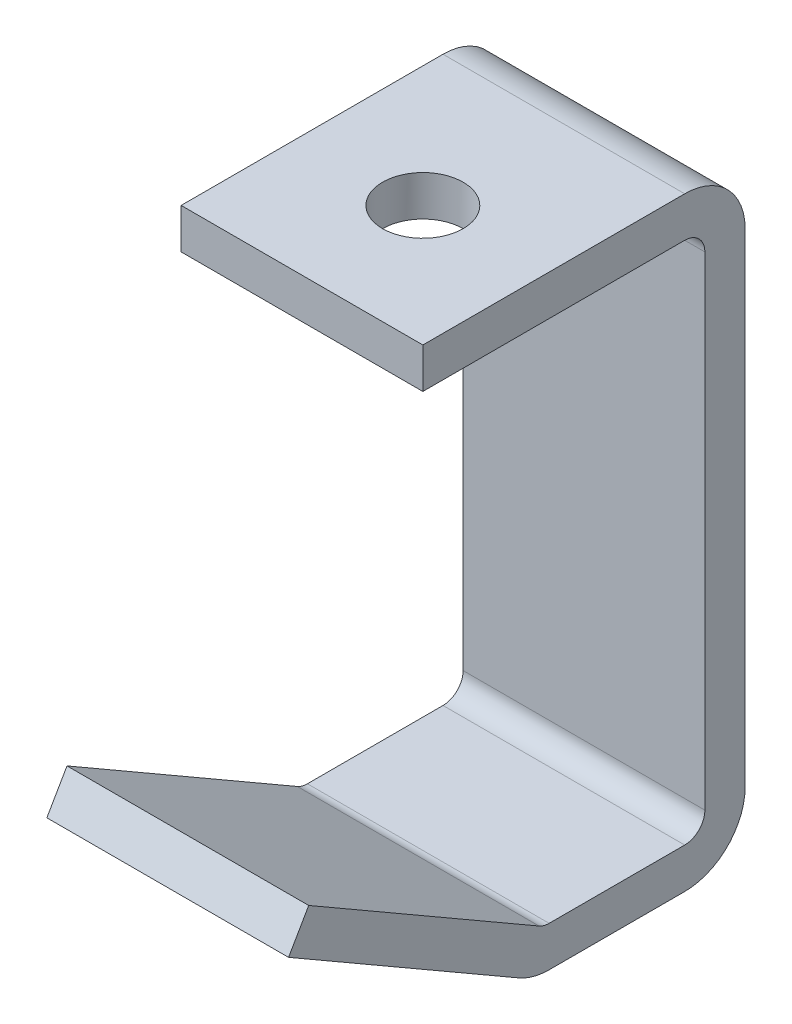
ISO-10303-21;
HEADER;
FILE_DESCRIPTION(('STEP AP214'),'2;1');
FILE_NAME('part.step','',(''),(''),'','','');
FILE_SCHEMA(('AUTOMOTIVE_DESIGN { 1 0 10303 214 1 1 1 1 }'));
ENDSEC;
DATA;
#1=APPLICATION_CONTEXT('core data for automotive mechanical design processes');
#2=APPLICATION_PROTOCOL_DEFINITION('international standard','automotive_design',2000,#1);
#3=PRODUCT_CONTEXT('',#1,'mechanical');
#4=PRODUCT('Part','Part','',(#3));
#5=PRODUCT_RELATED_PRODUCT_CATEGORY('part','',(#4));
#6=PRODUCT_DEFINITION_FORMATION('','',#4);
#7=PRODUCT_DEFINITION_CONTEXT('part definition',#1,'design');
#8=PRODUCT_DEFINITION('design','',#6,#7);
#9=PRODUCT_DEFINITION_SHAPE('','',#8);
#10=(LENGTH_UNIT() NAMED_UNIT(*) SI_UNIT(.MILLI.,.METRE.));
#11=(NAMED_UNIT(*) PLANE_ANGLE_UNIT() SI_UNIT($,.RADIAN.));
#12=(NAMED_UNIT(*) SI_UNIT($,.STERADIAN.) SOLID_ANGLE_UNIT());
#13=UNCERTAINTY_MEASURE_WITH_UNIT(LENGTH_MEASURE(1.E-05),#10,'distance_accuracy_value','');
#14=(GEOMETRIC_REPRESENTATION_CONTEXT(3) GLOBAL_UNCERTAINTY_ASSIGNED_CONTEXT((#13)) GLOBAL_UNIT_ASSIGNED_CONTEXT((#10,
#11,#12)) REPRESENTATION_CONTEXT('',''));
#15=CARTESIAN_POINT('',(0.,0.,0.));
#16=DIRECTION('',(0.,0.,1.));
#17=DIRECTION('',(1.,0.,0.));
#18=AXIS2_PLACEMENT_3D('',#15,#16,#17);
#19=CARTESIAN_POINT('',(19.05,88.9,3.175));
#20=DIRECTION('',(0.,-1.,0.));
#21=DIRECTION('',(0.,0.,-1.));
#22=AXIS2_PLACEMENT_3D('',#19,#20,#21);
#23=PLANE('',#22);
#24=CARTESIAN_POINT('',(0.,88.9,25.4));
#25=DIRECTION('',(0.,1.,0.));
#26=DIRECTION('',(0.,0.,1.));
#27=AXIS2_PLACEMENT_3D('',#24,#25,#26);
#28=CIRCLE('',#27,6.35);
#29=CARTESIAN_POINT('',(0.,88.9,31.75));
#30=VERTEX_POINT('',#29);
#31=EDGE_CURVE('E159',#30,#30,#28,.T.);
#32=ORIENTED_EDGE('',*,*,#31,.F.);
#33=EDGE_LOOP('',(#32));
#34=FACE_BOUND('',#33,.T.);
#35=DIRECTION('',(0.,0.,-1.));
#36=VECTOR('',#35,1.);
#37=CARTESIAN_POINT('',(-19.05,88.9,3.175));
#38=LINE('',#37,#36);
#39=CARTESIAN_POINT('',(-19.05,88.9,3.175));
#40=VERTEX_POINT('',#39);
#41=CARTESIAN_POINT('',(-19.05,88.9,44.45));
#42=VERTEX_POINT('',#41);
#43=EDGE_CURVE('E155',#40,#42,#38,.F.);
#44=ORIENTED_EDGE('',*,*,#43,.T.);
#45=DIRECTION('',(-1.,0.,0.));
#46=VECTOR('',#45,1.);
#47=CARTESIAN_POINT('',(19.05,88.9,44.45));
#48=LINE('',#47,#46);
#49=CARTESIAN_POINT('',(19.05,88.9,44.45));
#50=VERTEX_POINT('',#49);
#51=EDGE_CURVE('E11',#50,#42,#48,.T.);
#52=ORIENTED_EDGE('',*,*,#51,.F.);
#53=DIRECTION('',(0.,0.,-1.));
#54=VECTOR('',#53,1.);
#55=CARTESIAN_POINT('',(19.05,88.9,3.175));
#56=LINE('',#55,#54);
#57=CARTESIAN_POINT('',(19.05,88.9,3.175));
#58=VERTEX_POINT('',#57);
#59=EDGE_CURVE('E201',#58,#50,#56,.F.);
#60=ORIENTED_EDGE('',*,*,#59,.F.);
#61=DIRECTION('',(-1.,0.,0.));
#62=VECTOR('',#61,1.);
#63=CARTESIAN_POINT('',(19.05,88.9,3.175));
#64=LINE('',#63,#62);
#65=EDGE_CURVE('E156',#58,#40,#64,.T.);
#66=ORIENTED_EDGE('',*,*,#65,.T.);
#67=EDGE_LOOP('',(#44,#52,#60,#66));
#68=FACE_BOUND('',#67,.T.);
#69=ADVANCED_FACE('F33',(#34,#68),#23,.F.);
#70=CARTESIAN_POINT('',(19.05,82.55,44.45));
#71=DIRECTION('',(0.,0.,1.));
#72=DIRECTION('',(1.,0.,0.));
#73=AXIS2_PLACEMENT_3D('',#70,#71,#72);
#74=PLANE('',#73);
#75=DIRECTION('',(0.,1.,0.));
#76=VECTOR('',#75,1.);
#77=CARTESIAN_POINT('',(-19.05,82.55,44.45));
#78=LINE('',#77,#76);
#79=CARTESIAN_POINT('',(-19.05,82.55,44.45));
#80=VERTEX_POINT('',#79);
#81=EDGE_CURVE('E147',#80,#42,#78,.T.);
#82=ORIENTED_EDGE('',*,*,#81,.F.);
#83=DIRECTION('',(-1.,0.,0.));
#84=VECTOR('',#83,1.);
#85=CARTESIAN_POINT('',(19.05,82.55,44.45));
#86=LINE('',#85,#84);
#87=CARTESIAN_POINT('',(19.05,82.55,44.45));
#88=VERTEX_POINT('',#87);
#89=EDGE_CURVE('E40',#88,#80,#86,.T.);
#90=ORIENTED_EDGE('',*,*,#89,.F.);
#91=DIRECTION('',(0.,1.,0.));
#92=VECTOR('',#91,1.);
#93=CARTESIAN_POINT('',(19.05,82.55,44.45));
#94=LINE('',#93,#92);
#95=EDGE_CURVE('E150',#88,#50,#94,.T.);
#96=ORIENTED_EDGE('',*,*,#95,.T.);
#97=ORIENTED_EDGE('',*,*,#51,.T.);
#98=EDGE_LOOP('',(#82,#90,#96,#97));
#99=FACE_BOUND('',#98,.T.);
#100=ADVANCED_FACE('F145',(#99),#74,.T.);
#101=CARTESIAN_POINT('',(19.05,82.55,3.175));
#102=DIRECTION('',(0.,-1.,0.));
#103=DIRECTION('',(0.,0.,-1.));
#104=AXIS2_PLACEMENT_3D('',#101,#102,#103);
#105=PLANE('',#104);
#106=CARTESIAN_POINT('',(0.,82.55,25.4));
#107=DIRECTION('',(0.,-1.,0.));
#108=DIRECTION('',(0.,0.,-1.));
#109=AXIS2_PLACEMENT_3D('',#106,#107,#108);
#110=CIRCLE('',#109,6.35);
#111=CARTESIAN_POINT('',(0.,82.55,19.05));
#112=VERTEX_POINT('',#111);
#113=EDGE_CURVE('E342',#112,#112,#110,.F.);
#114=ORIENTED_EDGE('',*,*,#113,.T.);
#115=EDGE_LOOP('',(#114));
#116=FACE_BOUND('',#115,.T.);
#117=DIRECTION('',(0.,0.,1.));
#118=VECTOR('',#117,1.);
#119=CARTESIAN_POINT('',(-19.05,82.55,3.175));
#120=LINE('',#119,#118);
#121=CARTESIAN_POINT('',(-19.05,82.55,3.175));
#122=VERTEX_POINT('',#121);
#123=EDGE_CURVE('E164',#122,#80,#120,.T.);
#124=ORIENTED_EDGE('',*,*,#123,.F.);
#125=DIRECTION('',(-1.,0.,0.));
#126=VECTOR('',#125,1.);
#127=CARTESIAN_POINT('',(19.05,82.55,3.175));
#128=LINE('',#127,#126);
#129=CARTESIAN_POINT('',(19.05,82.55,3.175));
#130=VERTEX_POINT('',#129);
#131=EDGE_CURVE('E268',#130,#122,#128,.T.);
#132=ORIENTED_EDGE('',*,*,#131,.F.);
#133=DIRECTION('',(0.,0.,1.));
#134=VECTOR('',#133,1.);
#135=CARTESIAN_POINT('',(19.05,82.55,3.175));
#136=LINE('',#135,#134);
#137=EDGE_CURVE('E204',#130,#88,#136,.T.);
#138=ORIENTED_EDGE('',*,*,#137,.T.);
#139=ORIENTED_EDGE('',*,*,#89,.T.);
#140=EDGE_LOOP('',(#124,#132,#138,#139));
#141=FACE_BOUND('',#140,.T.);
#142=ADVANCED_FACE('F270',(#116,#141),#105,.T.);
#143=CARTESIAN_POINT('',(19.05,79.375,3.175));
#144=DIRECTION('',(-1.,0.,0.));
#145=DIRECTION('',(0.,0.,1.));
#146=AXIS2_PLACEMENT_3D('',#143,#144,#145);
#147=CYLINDRICAL_SURFACE('',#146,3.175);
#148=CARTESIAN_POINT('',(-19.05,79.375,3.175));
#149=DIRECTION('',(1.,0.,0.));
#150=DIRECTION('',(0.,0.,-1.));
#151=AXIS2_PLACEMENT_3D('',#148,#149,#150);
#152=CIRCLE('',#151,3.175);
#153=CARTESIAN_POINT('',(-19.05,79.375,0.));
#154=VERTEX_POINT('',#153);
#155=EDGE_CURVE('E166',#154,#122,#152,.T.);
#156=ORIENTED_EDGE('',*,*,#155,.F.);
#157=DIRECTION('',(-1.,0.,0.));
#158=VECTOR('',#157,1.);
#159=CARTESIAN_POINT('',(19.05,79.375,0.));
#160=LINE('',#159,#158);
#161=CARTESIAN_POINT('',(19.05,79.375,0.));
#162=VERTEX_POINT('',#161);
#163=EDGE_CURVE('E266',#162,#154,#160,.T.);
#164=ORIENTED_EDGE('',*,*,#163,.F.);
#165=CARTESIAN_POINT('',(19.05,79.375,3.175));
#166=DIRECTION('',(1.,0.,0.));
#167=DIRECTION('',(0.,0.,-1.));
#168=AXIS2_PLACEMENT_3D('',#165,#166,#167);
#169=CIRCLE('',#168,3.175);
#170=EDGE_CURVE('E207',#162,#130,#169,.T.);
#171=ORIENTED_EDGE('',*,*,#170,.T.);
#172=ORIENTED_EDGE('',*,*,#131,.T.);
#173=EDGE_LOOP('',(#156,#164,#171,#172));
#174=FACE_BOUND('',#173,.T.);
#175=ADVANCED_FACE('F277',(#174),#147,.F.);
#176=CARTESIAN_POINT('',(19.05,3.175,0.));
#177=DIRECTION('',(0.,0.,1.));
#178=DIRECTION('',(1.,0.,0.));
#179=AXIS2_PLACEMENT_3D('',#176,#177,#178);
#180=PLANE('',#179);
#181=DIRECTION('',(0.,1.,0.));
#182=VECTOR('',#181,1.);
#183=CARTESIAN_POINT('',(-19.05,3.175,0.));
#184=LINE('',#183,#182);
#185=CARTESIAN_POINT('',(-19.05,3.175,0.));
#186=VERTEX_POINT('',#185);
#187=EDGE_CURVE('E171',#186,#154,#184,.T.);
#188=ORIENTED_EDGE('',*,*,#187,.F.);
#189=DIRECTION('',(-1.,0.,0.));
#190=VECTOR('',#189,1.);
#191=CARTESIAN_POINT('',(19.05,3.175,0.));
#192=LINE('',#191,#190);
#193=CARTESIAN_POINT('',(19.05,3.175,0.));
#194=VERTEX_POINT('',#193);
#195=EDGE_CURVE('E264',#194,#186,#192,.T.);
#196=ORIENTED_EDGE('',*,*,#195,.F.);
#197=DIRECTION('',(0.,1.,0.));
#198=VECTOR('',#197,1.);
#199=CARTESIAN_POINT('',(19.05,3.175,0.));
#200=LINE('',#199,#198);
#201=EDGE_CURVE('E210',#194,#162,#200,.T.);
#202=ORIENTED_EDGE('',*,*,#201,.T.);
#203=ORIENTED_EDGE('',*,*,#163,.T.);
#204=EDGE_LOOP('',(#188,#196,#202,#203));
#205=FACE_BOUND('',#204,.T.);
#206=ADVANCED_FACE('F280',(#205),#180,.T.);
#207=CARTESIAN_POINT('',(19.05,3.175,3.175));
#208=DIRECTION('',(-1.,0.,0.));
#209=DIRECTION('',(0.,0.,1.));
#210=AXIS2_PLACEMENT_3D('',#207,#208,#209);
#211=CYLINDRICAL_SURFACE('',#210,3.175);
#212=CARTESIAN_POINT('',(-19.05,3.175,3.175));
#213=DIRECTION('',(1.,0.,0.));
#214=DIRECTION('',(0.,0.,1.));
#215=AXIS2_PLACEMENT_3D('',#212,#213,#214);
#216=CIRCLE('',#215,3.175);
#217=CARTESIAN_POINT('',(-19.05,0.,3.175));
#218=VERTEX_POINT('',#217);
#219=EDGE_CURVE('E174',#218,#186,#216,.T.);
#220=ORIENTED_EDGE('',*,*,#219,.F.);
#221=DIRECTION('',(-1.,0.,0.));
#222=VECTOR('',#221,1.);
#223=CARTESIAN_POINT('',(19.05,0.,3.175));
#224=LINE('',#223,#222);
#225=CARTESIAN_POINT('',(19.05,0.,3.175));
#226=VERTEX_POINT('',#225);
#227=EDGE_CURVE('E262',#226,#218,#224,.T.);
#228=ORIENTED_EDGE('',*,*,#227,.F.);
#229=CARTESIAN_POINT('',(19.05,3.175,3.175));
#230=DIRECTION('',(1.,0.,0.));
#231=DIRECTION('',(0.,0.,1.));
#232=AXIS2_PLACEMENT_3D('',#229,#230,#231);
#233=CIRCLE('',#232,3.175);
#234=EDGE_CURVE('E213',#226,#194,#233,.T.);
#235=ORIENTED_EDGE('',*,*,#234,.T.);
#236=ORIENTED_EDGE('',*,*,#195,.T.);
#237=EDGE_LOOP('',(#220,#228,#235,#236));
#238=FACE_BOUND('',#237,.T.);
#239=ADVANCED_FACE('F285',(#238),#211,.F.);
#240=CARTESIAN_POINT('',(19.05,0.,24.5492613140311));
#241=DIRECTION('',(0.,1.,0.));
#242=DIRECTION('',(0.,0.,1.));
#243=AXIS2_PLACEMENT_3D('',#240,#241,#242);
#244=PLANE('',#243);
#245=DIRECTION('',(0.,0.,-1.));
#246=VECTOR('',#245,1.);
#247=CARTESIAN_POINT('',(-19.05,0.,24.5492613140311));
#248=LINE('',#247,#246);
#249=CARTESIAN_POINT('',(-19.05,0.,24.5492613140311));
#250=VERTEX_POINT('',#249);
#251=EDGE_CURVE('E177',#250,#218,#248,.T.);
#252=ORIENTED_EDGE('',*,*,#251,.F.);
#253=DIRECTION('',(-1.,0.,0.));
#254=VECTOR('',#253,1.);
#255=CARTESIAN_POINT('',(19.05,0.,24.5492613140311));
#256=LINE('',#255,#254);
#257=CARTESIAN_POINT('',(19.05,0.,24.5492613140311));
#258=VERTEX_POINT('',#257);
#259=EDGE_CURVE('E260',#258,#250,#256,.T.);
#260=ORIENTED_EDGE('',*,*,#259,.F.);
#261=DIRECTION('',(0.,0.,-1.));
#262=VECTOR('',#261,1.);
#263=CARTESIAN_POINT('',(19.05,0.,24.5492613140311));
#264=LINE('',#263,#262);
#265=EDGE_CURVE('E216',#258,#226,#264,.T.);
#266=ORIENTED_EDGE('',*,*,#265,.T.);
#267=ORIENTED_EDGE('',*,*,#227,.T.);
#268=EDGE_LOOP('',(#252,#260,#266,#267));
#269=FACE_BOUND('',#268,.T.);
#270=ADVANCED_FACE('F288',(#269),#244,.T.);
#271=CARTESIAN_POINT('',(19.05,3.175,24.5492613140312));
#272=DIRECTION('',(-1.,0.,0.));
#273=DIRECTION('',(0.,0.,1.));
#274=AXIS2_PLACEMENT_3D('',#271,#272,#273);
#275=CYLINDRICAL_SURFACE('',#274,3.17499999999997);
#276=CARTESIAN_POINT('',(-19.05,3.175,24.5492613140312));
#277=DIRECTION('',(1.,0.,0.));
#278=DIRECTION('',(0.,0.,-1.));
#279=AXIS2_PLACEMENT_3D('',#276,#277,#278);
#280=CIRCLE('',#279,3.17499999999997);
#281=CARTESIAN_POINT('',(-19.05,0.425369342984382,26.1367613140311));
#282=VERTEX_POINT('',#281);
#283=EDGE_CURVE('E180',#282,#250,#280,.T.);
#284=ORIENTED_EDGE('',*,*,#283,.F.);
#285=DIRECTION('',(-1.,0.,0.));
#286=VECTOR('',#285,1.);
#287=CARTESIAN_POINT('',(19.05,0.425369342984382,26.1367613140311));
#288=LINE('',#287,#286);
#289=CARTESIAN_POINT('',(19.05,0.425369342984382,26.1367613140311));
#290=VERTEX_POINT('',#289);
#291=EDGE_CURVE('E258',#290,#282,#288,.T.);
#292=ORIENTED_EDGE('',*,*,#291,.F.);
#293=CARTESIAN_POINT('',(19.05,3.175,24.5492613140312));
#294=DIRECTION('',(1.,0.,0.));
#295=DIRECTION('',(0.,0.,-1.));
#296=AXIS2_PLACEMENT_3D('',#293,#294,#295);
#297=CIRCLE('',#296,3.17499999999997);
#298=EDGE_CURVE('E219',#290,#258,#297,.T.);
#299=ORIENTED_EDGE('',*,*,#298,.T.);
#300=ORIENTED_EDGE('',*,*,#259,.T.);
#301=EDGE_LOOP('',(#284,#292,#299,#300));
#302=FACE_BOUND('',#301,.T.);
#303=ADVANCED_FACE('F293',(#302),#275,.F.);
#304=CARTESIAN_POINT('',(19.05,21.3868000000001,62.443024211314));
#305=DIRECTION('',(0.,0.866025403784439,-0.5));
#306=DIRECTION('',(0.,0.5,0.866025403784438));
#307=AXIS2_PLACEMENT_3D('',#304,#305,#306);
#308=PLANE('',#307);
#309=DIRECTION('',(0.,-0.5,-0.866025403784439));
#310=VECTOR('',#309,1.);
#311=CARTESIAN_POINT('',(-19.05,21.3868000000001,62.443024211314));
#312=LINE('',#311,#310);
#313=CARTESIAN_POINT('',(-19.05,21.3868000000001,62.443024211314));
#314=VERTEX_POINT('',#313);
#315=EDGE_CURVE('E183',#314,#282,#312,.T.);
#316=ORIENTED_EDGE('',*,*,#315,.F.);
#317=DIRECTION('',(-1.,0.,0.));
#318=VECTOR('',#317,1.);
#319=CARTESIAN_POINT('',(19.05,21.3868000000001,62.443024211314));
#320=LINE('',#319,#318);
#321=CARTESIAN_POINT('',(19.05,21.3868000000001,62.443024211314));
#322=VERTEX_POINT('',#321);
#323=EDGE_CURVE('E256',#322,#314,#320,.T.);
#324=ORIENTED_EDGE('',*,*,#323,.F.);
#325=DIRECTION('',(0.,-0.5,-0.866025403784439));
#326=VECTOR('',#325,1.);
#327=CARTESIAN_POINT('',(19.05,21.3868000000001,62.443024211314));
#328=LINE('',#327,#326);
#329=EDGE_CURVE('E222',#322,#290,#328,.T.);
#330=ORIENTED_EDGE('',*,*,#329,.T.);
#331=ORIENTED_EDGE('',*,*,#291,.T.);
#332=EDGE_LOOP('',(#316,#324,#330,#331));
#333=FACE_BOUND('',#332,.T.);
#334=ADVANCED_FACE('F296',(#333),#308,.T.);
#335=CARTESIAN_POINT('',(19.05,15.8875386859689,65.618024211314));
#336=DIRECTION('',(0.,0.500000000000001,0.866025403784438));
#337=DIRECTION('',(0.,-0.866025403784438,0.500000000000001));
#338=AXIS2_PLACEMENT_3D('',#335,#336,#337);
#339=PLANE('',#338);
#340=DIRECTION('',(0.,0.866025403784438,-0.500000000000001));
#341=VECTOR('',#340,1.);
#342=CARTESIAN_POINT('',(-19.05,15.8875386859689,65.618024211314));
#343=LINE('',#342,#341);
#344=CARTESIAN_POINT('',(-19.05,15.8875386859689,65.618024211314));
#345=VERTEX_POINT('',#344);
#346=EDGE_CURVE('E186',#345,#314,#343,.T.);
#347=ORIENTED_EDGE('',*,*,#346,.F.);
#348=DIRECTION('',(-1.,0.,0.));
#349=VECTOR('',#348,1.);
#350=CARTESIAN_POINT('',(19.05,15.8875386859689,65.618024211314));
#351=LINE('',#350,#349);
#352=CARTESIAN_POINT('',(19.05,15.8875386859689,65.618024211314));
#353=VERTEX_POINT('',#352);
#354=EDGE_CURVE('E254',#353,#345,#351,.T.);
#355=ORIENTED_EDGE('',*,*,#354,.F.);
#356=DIRECTION('',(0.,0.866025403784438,-0.500000000000001));
#357=VECTOR('',#356,1.);
#358=CARTESIAN_POINT('',(19.05,15.8875386859689,65.618024211314));
#359=LINE('',#358,#357);
#360=EDGE_CURVE('E225',#353,#322,#359,.T.);
#361=ORIENTED_EDGE('',*,*,#360,.T.);
#362=ORIENTED_EDGE('',*,*,#323,.T.);
#363=EDGE_LOOP('',(#347,#355,#361,#362));
#364=FACE_BOUND('',#363,.T.);
#365=ADVANCED_FACE('F300',(#364),#339,.T.);
#366=CARTESIAN_POINT('',(19.05,15.8875386859689,65.618024211314));
#367=DIRECTION('',(0.,0.866025403784439,-0.5));
#368=DIRECTION('',(0.,0.5,0.866025403784438));
#369=AXIS2_PLACEMENT_3D('',#366,#367,#368);
#370=PLANE('',#369);
#371=DIRECTION('',(0.,-0.5,-0.866025403784439));
#372=VECTOR('',#371,1.);
#373=CARTESIAN_POINT('',(-19.05,15.8875386859689,65.618024211314));
#374=LINE('',#373,#372);
#375=CARTESIAN_POINT('',(-19.05,-5.0738919710469,29.3117613140309));
#376=VERTEX_POINT('',#375);
#377=EDGE_CURVE('E189',#345,#376,#374,.T.);
#378=ORIENTED_EDGE('',*,*,#377,.T.);
#379=DIRECTION('',(-1.,0.,0.));
#380=VECTOR('',#379,1.);
#381=CARTESIAN_POINT('',(19.05,-5.0738919710469,29.3117613140309));
#382=LINE('',#381,#380);
#383=CARTESIAN_POINT('',(19.05,-5.0738919710469,29.3117613140309));
#384=VERTEX_POINT('',#383);
#385=EDGE_CURVE('E251',#384,#376,#382,.T.);
#386=ORIENTED_EDGE('',*,*,#385,.F.);
#387=DIRECTION('',(0.,-0.5,-0.866025403784439));
#388=VECTOR('',#387,1.);
#389=CARTESIAN_POINT('',(19.05,15.8875386859689,65.618024211314));
#390=LINE('',#389,#388);
#391=EDGE_CURVE('E228',#353,#384,#390,.T.);
#392=ORIENTED_EDGE('',*,*,#391,.F.);
#393=ORIENTED_EDGE('',*,*,#354,.T.);
#394=EDGE_LOOP('',(#378,#386,#392,#393));
#395=FACE_BOUND('',#394,.T.);
#396=ADVANCED_FACE('F305',(#395),#370,.F.);
#397=CARTESIAN_POINT('',(19.05,3.175,24.5492613140312));
#398=DIRECTION('',(-1.,0.,0.));
#399=DIRECTION('',(0.,0.,1.));
#400=AXIS2_PLACEMENT_3D('',#397,#398,#399);
#401=CYLINDRICAL_SURFACE('',#400,9.52499999999997);
#402=CARTESIAN_POINT('',(-19.05,3.175,24.5492613140312));
#403=DIRECTION('',(1.,0.,0.));
#404=DIRECTION('',(0.,0.,-1.));
#405=AXIS2_PLACEMENT_3D('',#402,#403,#404);
#406=CIRCLE('',#405,9.52499999999997);
#407=CARTESIAN_POINT('',(-19.05,-6.35,24.5492613140311));
#408=VERTEX_POINT('',#407);
#409=EDGE_CURVE('E191',#376,#408,#406,.T.);
#410=ORIENTED_EDGE('',*,*,#409,.T.);
#411=DIRECTION('',(-1.,0.,0.));
#412=VECTOR('',#411,1.);
#413=CARTESIAN_POINT('',(19.05,-6.35,24.5492613140311));
#414=LINE('',#413,#412);
#415=CARTESIAN_POINT('',(19.05,-6.35,24.5492613140311));
#416=VERTEX_POINT('',#415);
#417=EDGE_CURVE('E248',#416,#408,#414,.T.);
#418=ORIENTED_EDGE('',*,*,#417,.F.);
#419=CARTESIAN_POINT('',(19.05,3.175,24.5492613140312));
#420=DIRECTION('',(1.,0.,0.));
#421=DIRECTION('',(0.,0.,-1.));
#422=AXIS2_PLACEMENT_3D('',#419,#420,#421);
#423=CIRCLE('',#422,9.52499999999997);
#424=EDGE_CURVE('E230',#384,#416,#423,.T.);
#425=ORIENTED_EDGE('',*,*,#424,.F.);
#426=ORIENTED_EDGE('',*,*,#385,.T.);
#427=EDGE_LOOP('',(#410,#418,#425,#426));
#428=FACE_BOUND('',#427,.T.);
#429=ADVANCED_FACE('F311',(#428),#401,.T.);
#430=CARTESIAN_POINT('',(19.05,-6.35,24.5492613140311));
#431=DIRECTION('',(0.,1.,0.));
#432=DIRECTION('',(0.,0.,1.));
#433=AXIS2_PLACEMENT_3D('',#430,#431,#432);
#434=PLANE('',#433);
#435=DIRECTION('',(0.,0.,-1.));
#436=VECTOR('',#435,1.);
#437=CARTESIAN_POINT('',(-19.05,-6.35,24.5492613140311));
#438=LINE('',#437,#436);
#439=CARTESIAN_POINT('',(-19.05,-6.35,3.175));
#440=VERTEX_POINT('',#439);
#441=EDGE_CURVE('E193',#408,#440,#438,.T.);
#442=ORIENTED_EDGE('',*,*,#441,.T.);
#443=DIRECTION('',(-1.,0.,0.));
#444=VECTOR('',#443,1.);
#445=CARTESIAN_POINT('',(19.05,-6.35,3.175));
#446=LINE('',#445,#444);
#447=CARTESIAN_POINT('',(19.05,-6.35,3.175));
#448=VERTEX_POINT('',#447);
#449=EDGE_CURVE('E245',#448,#440,#446,.T.);
#450=ORIENTED_EDGE('',*,*,#449,.F.);
#451=DIRECTION('',(0.,0.,-1.));
#452=VECTOR('',#451,1.);
#453=CARTESIAN_POINT('',(19.05,-6.35,24.5492613140311));
#454=LINE('',#453,#452);
#455=EDGE_CURVE('E232',#416,#448,#454,.T.);
#456=ORIENTED_EDGE('',*,*,#455,.F.);
#457=ORIENTED_EDGE('',*,*,#417,.T.);
#458=EDGE_LOOP('',(#442,#450,#456,#457));
#459=FACE_BOUND('',#458,.T.);
#460=ADVANCED_FACE('F315',(#459),#434,.F.);
#461=CARTESIAN_POINT('',(19.05,3.175,3.175));
#462=DIRECTION('',(-1.,0.,0.));
#463=DIRECTION('',(0.,0.,1.));
#464=AXIS2_PLACEMENT_3D('',#461,#462,#463);
#465=CYLINDRICAL_SURFACE('',#464,9.525);
#466=CARTESIAN_POINT('',(-19.05,3.175,3.175));
#467=DIRECTION('',(1.,0.,0.));
#468=DIRECTION('',(0.,0.,-1.));
#469=AXIS2_PLACEMENT_3D('',#466,#467,#468);
#470=CIRCLE('',#469,9.525);
#471=CARTESIAN_POINT('',(-19.05,3.175,-6.35));
#472=VERTEX_POINT('',#471);
#473=EDGE_CURVE('E195',#440,#472,#470,.T.);
#474=ORIENTED_EDGE('',*,*,#473,.T.);
#475=DIRECTION('',(-1.,0.,0.));
#476=VECTOR('',#475,1.);
#477=CARTESIAN_POINT('',(19.05,3.175,-6.35));
#478=LINE('',#477,#476);
#479=CARTESIAN_POINT('',(19.05,3.175,-6.35));
#480=VERTEX_POINT('',#479);
#481=EDGE_CURVE('E242',#480,#472,#478,.T.);
#482=ORIENTED_EDGE('',*,*,#481,.F.);
#483=CARTESIAN_POINT('',(19.05,3.175,3.175));
#484=DIRECTION('',(1.,0.,0.));
#485=DIRECTION('',(0.,0.,-1.));
#486=AXIS2_PLACEMENT_3D('',#483,#484,#485);
#487=CIRCLE('',#486,9.525);
#488=EDGE_CURVE('E234',#448,#480,#487,.T.);
#489=ORIENTED_EDGE('',*,*,#488,.F.);
#490=ORIENTED_EDGE('',*,*,#449,.T.);
#491=EDGE_LOOP('',(#474,#482,#489,#490));
#492=FACE_BOUND('',#491,.T.);
#493=ADVANCED_FACE('F320',(#492),#465,.T.);
#494=CARTESIAN_POINT('',(19.05,3.175,-6.35));
#495=DIRECTION('',(0.,0.,1.));
#496=DIRECTION('',(1.,0.,0.));
#497=AXIS2_PLACEMENT_3D('',#494,#495,#496);
#498=PLANE('',#497);
#499=DIRECTION('',(0.,1.,0.));
#500=VECTOR('',#499,1.);
#501=CARTESIAN_POINT('',(-19.05,3.175,-6.35));
#502=LINE('',#501,#500);
#503=CARTESIAN_POINT('',(-19.05,79.375,-6.35));
#504=VERTEX_POINT('',#503);
#505=EDGE_CURVE('E197',#472,#504,#502,.T.);
#506=ORIENTED_EDGE('',*,*,#505,.T.);
#507=DIRECTION('',(-1.,0.,0.));
#508=VECTOR('',#507,1.);
#509=CARTESIAN_POINT('',(19.05,79.375,-6.35));
#510=LINE('',#509,#508);
#511=CARTESIAN_POINT('',(19.05,79.375,-6.35));
#512=VERTEX_POINT('',#511);
#513=EDGE_CURVE('E239',#512,#504,#510,.T.);
#514=ORIENTED_EDGE('',*,*,#513,.F.);
#515=DIRECTION('',(0.,1.,0.));
#516=VECTOR('',#515,1.);
#517=CARTESIAN_POINT('',(19.05,3.175,-6.35));
#518=LINE('',#517,#516);
#519=EDGE_CURVE('E52',#480,#512,#518,.T.);
#520=ORIENTED_EDGE('',*,*,#519,.F.);
#521=ORIENTED_EDGE('',*,*,#481,.T.);
#522=EDGE_LOOP('',(#506,#514,#520,#521));
#523=FACE_BOUND('',#522,.T.);
#524=ADVANCED_FACE('F323',(#523),#498,.F.);
#525=CARTESIAN_POINT('',(19.05,79.375,3.175));
#526=DIRECTION('',(-1.,0.,0.));
#527=DIRECTION('',(0.,0.,1.));
#528=AXIS2_PLACEMENT_3D('',#525,#526,#527);
#529=CYLINDRICAL_SURFACE('',#528,9.525);
#530=CARTESIAN_POINT('',(-19.05,79.375,3.175));
#531=DIRECTION('',(1.,0.,0.));
#532=DIRECTION('',(0.,0.,-1.));
#533=AXIS2_PLACEMENT_3D('',#530,#531,#532);
#534=CIRCLE('',#533,9.525);
#535=EDGE_CURVE('E199',#504,#40,#534,.T.);
#536=ORIENTED_EDGE('',*,*,#535,.T.);
#537=ORIENTED_EDGE('',*,*,#65,.F.);
#538=CARTESIAN_POINT('',(19.05,79.375,3.175));
#539=DIRECTION('',(1.,0.,0.));
#540=DIRECTION('',(0.,0.,-1.));
#541=AXIS2_PLACEMENT_3D('',#538,#539,#540);
#542=CIRCLE('',#541,9.525);
#543=EDGE_CURVE('E47',#512,#58,#542,.T.);
#544=ORIENTED_EDGE('',*,*,#543,.F.);
#545=ORIENTED_EDGE('',*,*,#513,.T.);
#546=EDGE_LOOP('',(#536,#537,#544,#545));
#547=FACE_BOUND('',#546,.T.);
#548=ADVANCED_FACE('F325',(#547),#529,.T.);
#549=CARTESIAN_POINT('',(19.05,79.375,3.175));
#550=DIRECTION('',(1.,0.,0.));
#551=DIRECTION('',(0.,0.,-1.));
#552=AXIS2_PLACEMENT_3D('',#549,#550,#551);
#553=PLANE('',#552);
#554=ORIENTED_EDGE('',*,*,#59,.T.);
#555=ORIENTED_EDGE('',*,*,#95,.F.);
#556=ORIENTED_EDGE('',*,*,#137,.F.);
#557=ORIENTED_EDGE('',*,*,#170,.F.);
#558=ORIENTED_EDGE('',*,*,#201,.F.);
#559=ORIENTED_EDGE('',*,*,#234,.F.);
#560=ORIENTED_EDGE('',*,*,#265,.F.);
#561=ORIENTED_EDGE('',*,*,#298,.F.);
#562=ORIENTED_EDGE('',*,*,#329,.F.);
#563=ORIENTED_EDGE('',*,*,#360,.F.);
#564=ORIENTED_EDGE('',*,*,#391,.T.);
#565=ORIENTED_EDGE('',*,*,#424,.T.);
#566=ORIENTED_EDGE('',*,*,#455,.T.);
#567=ORIENTED_EDGE('',*,*,#488,.T.);
#568=ORIENTED_EDGE('',*,*,#519,.T.);
#569=ORIENTED_EDGE('',*,*,#543,.T.);
#570=EDGE_LOOP('',(#554,#555,#556,#557,#558,#559,#560,#561,#562,#563,#564,#565,#566,#567,#568,#569));
#571=FACE_BOUND('',#570,.T.);
#572=ADVANCED_FACE('F272',(#571),#553,.T.);
#573=CARTESIAN_POINT('',(-19.05,79.375,3.175));
#574=DIRECTION('',(1.,0.,0.));
#575=DIRECTION('',(0.,0.,-1.));
#576=AXIS2_PLACEMENT_3D('',#573,#574,#575);
#577=PLANE('',#576);
#578=ORIENTED_EDGE('',*,*,#43,.F.);
#579=ORIENTED_EDGE('',*,*,#535,.F.);
#580=ORIENTED_EDGE('',*,*,#505,.F.);
#581=ORIENTED_EDGE('',*,*,#473,.F.);
#582=ORIENTED_EDGE('',*,*,#441,.F.);
#583=ORIENTED_EDGE('',*,*,#409,.F.);
#584=ORIENTED_EDGE('',*,*,#377,.F.);
#585=ORIENTED_EDGE('',*,*,#346,.T.);
#586=ORIENTED_EDGE('',*,*,#315,.T.);
#587=ORIENTED_EDGE('',*,*,#283,.T.);
#588=ORIENTED_EDGE('',*,*,#251,.T.);
#589=ORIENTED_EDGE('',*,*,#219,.T.);
#590=ORIENTED_EDGE('',*,*,#187,.T.);
#591=ORIENTED_EDGE('',*,*,#155,.T.);
#592=ORIENTED_EDGE('',*,*,#123,.T.);
#593=ORIENTED_EDGE('',*,*,#81,.T.);
#594=EDGE_LOOP('',(#578,#579,#580,#581,#582,#583,#584,#585,#586,#587,#588,#589,#590,#591,#592,#593));
#595=FACE_BOUND('',#594,.T.);
#596=ADVANCED_FACE('F161',(#595),#577,.F.);
#597=CARTESIAN_POINT('',(0.,-6.35100000000001,25.4));
#598=DIRECTION('',(0.,1.,0.));
#599=DIRECTION('',(0.,0.,1.));
#600=AXIS2_PLACEMENT_3D('',#597,#598,#599);
#601=CYLINDRICAL_SURFACE('',#600,6.35);
#602=ORIENTED_EDGE('',*,*,#113,.F.);
#603=EDGE_LOOP('',(#602));
#604=FACE_BOUND('',#603,.T.);
#605=ORIENTED_EDGE('',*,*,#31,.T.);
#606=EDGE_LOOP('',(#605));
#607=FACE_BOUND('',#606,.T.);
#608=ADVANCED_FACE('F348',(#604,#607),#601,.F.);
#609=CLOSED_SHELL('',(#69,#100,#142,#175,#206,#239,#270,#303,#334,#365,#396,#429,#460,#493,#524,
#548,#572,#596,#608));
#610=MANIFOLD_SOLID_BREP('B2',#609);
#611=ADVANCED_BREP_SHAPE_REPRESENTATION('',(#18,#610),#14);
#612=SHAPE_DEFINITION_REPRESENTATION(#9,#611);
ENDSEC;
END-ISO-10303-21;
